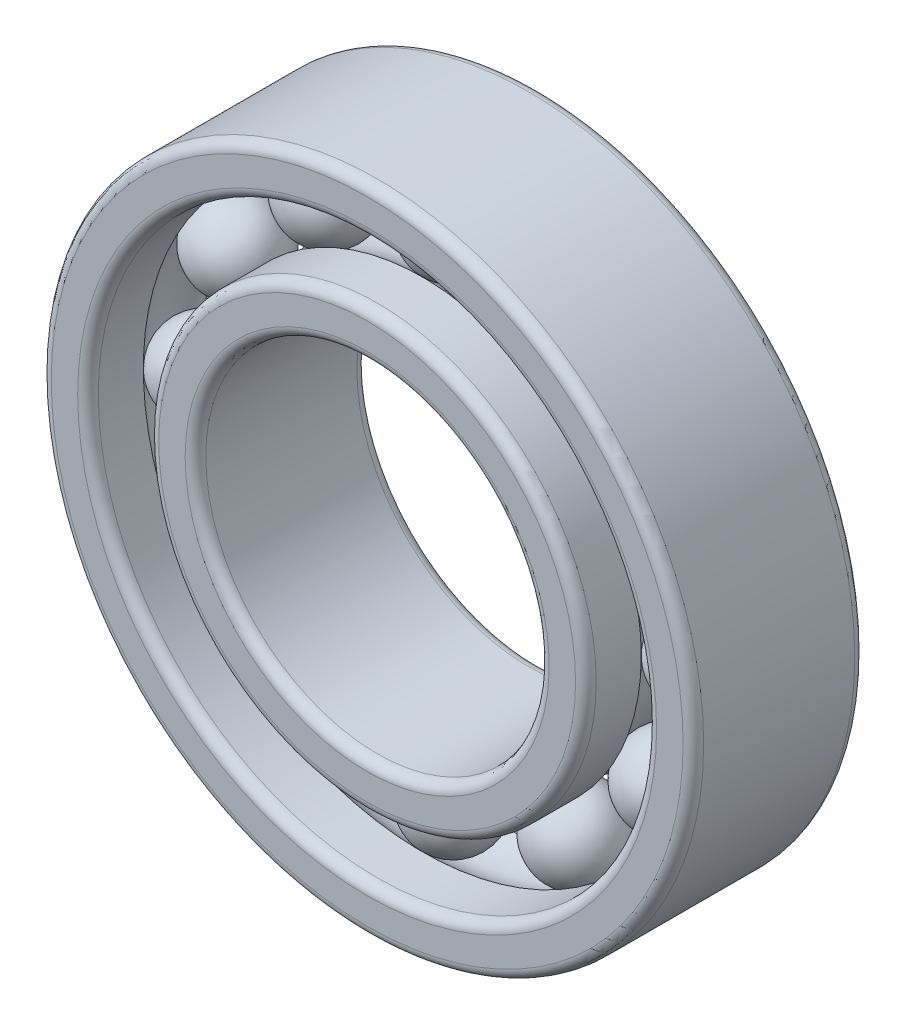
ISO-10303-21;
HEADER;
FILE_DESCRIPTION(('STEP AP214'),'2;1');
FILE_NAME('part.step','',(''),(''),'','','');
FILE_SCHEMA(('AUTOMOTIVE_DESIGN { 1 0 10303 214 1 1 1 1 }'));
ENDSEC;
DATA;
#1=APPLICATION_CONTEXT('core data for automotive mechanical design processes');
#2=APPLICATION_PROTOCOL_DEFINITION('international standard','automotive_design',2000,#1);
#3=PRODUCT_CONTEXT('',#1,'mechanical');
#4=PRODUCT('Part','Part','',(#3));
#5=PRODUCT_RELATED_PRODUCT_CATEGORY('part','',(#4));
#6=PRODUCT_DEFINITION_FORMATION('','',#4);
#7=PRODUCT_DEFINITION_CONTEXT('part definition',#1,'design');
#8=PRODUCT_DEFINITION('design','',#6,#7);
#9=PRODUCT_DEFINITION_SHAPE('','',#8);
#10=(LENGTH_UNIT() NAMED_UNIT(*) SI_UNIT(.MILLI.,.METRE.));
#11=(NAMED_UNIT(*) PLANE_ANGLE_UNIT() SI_UNIT($,.RADIAN.));
#12=(NAMED_UNIT(*) SI_UNIT($,.STERADIAN.) SOLID_ANGLE_UNIT());
#13=UNCERTAINTY_MEASURE_WITH_UNIT(LENGTH_MEASURE(1.E-05),#10,'distance_accuracy_value','');
#14=(GEOMETRIC_REPRESENTATION_CONTEXT(3) GLOBAL_UNCERTAINTY_ASSIGNED_CONTEXT((#13)) GLOBAL_UNIT_ASSIGNED_CONTEXT((#10,
#11,#12)) REPRESENTATION_CONTEXT('',''));
#15=CARTESIAN_POINT('',(0.,0.,0.));
#16=DIRECTION('',(0.,0.,1.));
#17=DIRECTION('',(1.,0.,0.));
#18=AXIS2_PLACEMENT_3D('',#15,#16,#17);
#19=CARTESIAN_POINT('',(3.62499999999992,6.27868417743723,0.));
#20=DIRECTION('',(0.,0.,1.));
#21=DIRECTION('',(0.499999999999989,0.866025403784445,0.));
#22=AXIS2_PLACEMENT_3D('',#19,#20,#21);
#23=SPHERICAL_SURFACE('',#22,1.25);
#24=CARTESIAN_POINT('',(3.62499999999992,6.27868417743723,1.25));
#25=VERTEX_POINT('',#24);
#26=VERTEX_LOOP('',#25);
#27=FACE_BOUND('',#26,.T.);
#28=ADVANCED_FACE('F38',(#27),#23,.T.);
#29=CLOSED_SHELL('',(#28));
#30=MANIFOLD_SOLID_BREP('B2',#29);
#31=CARTESIAN_POINT('',(6.27868417743714,3.62500000000007,0.));
#32=DIRECTION('',(0.,0.,1.));
#33=DIRECTION('',(0.866025403784433,0.50000000000001,0.));
#34=AXIS2_PLACEMENT_3D('',#31,#32,#33);
#35=SPHERICAL_SURFACE('',#34,1.25);
#36=CARTESIAN_POINT('',(6.27868417743714,3.62500000000007,1.25));
#37=VERTEX_POINT('',#36);
#38=VERTEX_LOOP('',#37);
#39=FACE_BOUND('',#38,.T.);
#40=ADVANCED_FACE('F57',(#39),#35,.T.);
#41=CLOSED_SHELL('',(#40));
#42=MANIFOLD_SOLID_BREP('B6',#41);
#43=CARTESIAN_POINT('',(7.25,0.,0.));
#44=DIRECTION('',(0.,0.,1.));
#45=DIRECTION('',(1.,0.,0.));
#46=AXIS2_PLACEMENT_3D('',#43,#44,#45);
#47=SPHERICAL_SURFACE('',#46,1.25);
#48=CARTESIAN_POINT('',(7.25,0.,1.25));
#49=VERTEX_POINT('',#48);
#50=VERTEX_LOOP('',#49);
#51=FACE_BOUND('',#50,.T.);
#52=ADVANCED_FACE('F76',(#51),#47,.T.);
#53=CLOSED_SHELL('',(#52));
#54=MANIFOLD_SOLID_BREP('B34',#53);
#55=CARTESIAN_POINT('',(6.27868417743721,-3.62499999999994,0.));
#56=DIRECTION('',(0.,0.,1.));
#57=DIRECTION('',(0.866025403784443,-0.499999999999992,0.));
#58=AXIS2_PLACEMENT_3D('',#55,#56,#57);
#59=SPHERICAL_SURFACE('',#58,1.25);
#60=CARTESIAN_POINT('',(6.27868417743721,-3.62499999999994,1.25));
#61=VERTEX_POINT('',#60);
#62=VERTEX_LOOP('',#61);
#63=FACE_BOUND('',#62,.T.);
#64=ADVANCED_FACE('F95',(#63),#59,.T.);
#65=CLOSED_SHELL('',(#64));
#66=MANIFOLD_SOLID_BREP('B53',#65);
#67=CARTESIAN_POINT('',(3.62500000000005,-6.27868417743715,0.));
#68=DIRECTION('',(0.,0.,1.));
#69=DIRECTION('',(0.500000000000007,-0.866025403784435,0.));
#70=AXIS2_PLACEMENT_3D('',#67,#68,#69);
#71=SPHERICAL_SURFACE('',#70,1.25);
#72=CARTESIAN_POINT('',(3.62500000000005,-6.27868417743715,1.25));
#73=VERTEX_POINT('',#72);
#74=VERTEX_LOOP('',#73);
#75=FACE_BOUND('',#74,.T.);
#76=ADVANCED_FACE('F114',(#75),#71,.T.);
#77=CLOSED_SHELL('',(#76));
#78=MANIFOLD_SOLID_BREP('B72',#77);
#79=CARTESIAN_POINT('',(0.,-7.25,0.));
#80=DIRECTION('',(0.,0.,1.));
#81=DIRECTION('',(0.,-1.,0.));
#82=AXIS2_PLACEMENT_3D('',#79,#80,#81);
#83=SPHERICAL_SURFACE('',#82,1.25);
#84=CARTESIAN_POINT('',(0.,-7.25,1.25));
#85=VERTEX_POINT('',#84);
#86=VERTEX_LOOP('',#85);
#87=FACE_BOUND('',#86,.T.);
#88=ADVANCED_FACE('F133',(#87),#83,.T.);
#89=CLOSED_SHELL('',(#88));
#90=MANIFOLD_SOLID_BREP('B91',#89);
#91=CARTESIAN_POINT('',(-3.62499999999996,-6.2786841774372,0.));
#92=DIRECTION('',(0.,0.,1.));
#93=DIRECTION('',(-0.499999999999995,-0.866025403784442,0.));
#94=AXIS2_PLACEMENT_3D('',#91,#92,#93);
#95=SPHERICAL_SURFACE('',#94,1.25);
#96=CARTESIAN_POINT('',(-3.62499999999996,-6.2786841774372,1.25));
#97=VERTEX_POINT('',#96);
#98=VERTEX_LOOP('',#97);
#99=FACE_BOUND('',#98,.T.);
#100=ADVANCED_FACE('F152',(#99),#95,.T.);
#101=CLOSED_SHELL('',(#100));
#102=MANIFOLD_SOLID_BREP('B110',#101);
#103=CARTESIAN_POINT('',(-6.27868417743716,-3.62500000000003,0.));
#104=DIRECTION('',(0.,0.,1.));
#105=DIRECTION('',(-0.866025403784436,-0.500000000000004,0.));
#106=AXIS2_PLACEMENT_3D('',#103,#104,#105);
#107=SPHERICAL_SURFACE('',#106,1.25);
#108=CARTESIAN_POINT('',(-6.27868417743716,-3.62500000000003,1.25));
#109=VERTEX_POINT('',#108);
#110=VERTEX_LOOP('',#109);
#111=FACE_BOUND('',#110,.T.);
#112=ADVANCED_FACE('F171',(#111),#107,.T.);
#113=CLOSED_SHELL('',(#112));
#114=MANIFOLD_SOLID_BREP('B129',#113);
#115=CARTESIAN_POINT('',(-7.25,0.,0.));
#116=DIRECTION('',(0.,0.,1.));
#117=DIRECTION('',(-1.,0.,0.));
#118=AXIS2_PLACEMENT_3D('',#115,#116,#117);
#119=SPHERICAL_SURFACE('',#118,1.25);
#120=CARTESIAN_POINT('',(-7.25,0.,1.25));
#121=VERTEX_POINT('',#120);
#122=VERTEX_LOOP('',#121);
#123=FACE_BOUND('',#122,.T.);
#124=ADVANCED_FACE('F190',(#123),#119,.T.);
#125=CLOSED_SHELL('',(#124));
#126=MANIFOLD_SOLID_BREP('B148',#125);
#127=CARTESIAN_POINT('',(-6.27868417743719,3.62499999999999,0.));
#128=DIRECTION('',(0.,0.,1.));
#129=DIRECTION('',(-0.86602540378444,0.499999999999998,0.));
#130=AXIS2_PLACEMENT_3D('',#127,#128,#129);
#131=SPHERICAL_SURFACE('',#130,1.25);
#132=CARTESIAN_POINT('',(-6.27868417743719,3.62499999999999,1.25));
#133=VERTEX_POINT('',#132);
#134=VERTEX_LOOP('',#133);
#135=FACE_BOUND('',#134,.T.);
#136=ADVANCED_FACE('F209',(#135),#131,.T.);
#137=CLOSED_SHELL('',(#136));
#138=MANIFOLD_SOLID_BREP('B167',#137);
#139=CARTESIAN_POINT('',(-3.62500000000001,6.27868417743718,0.));
#140=DIRECTION('',(0.,0.,1.));
#141=DIRECTION('',(-0.500000000000001,0.866025403784438,0.));
#142=AXIS2_PLACEMENT_3D('',#139,#140,#141);
#143=SPHERICAL_SURFACE('',#142,1.25);
#144=CARTESIAN_POINT('',(-3.62500000000001,6.27868417743718,1.25));
#145=VERTEX_POINT('',#144);
#146=VERTEX_LOOP('',#145);
#147=FACE_BOUND('',#146,.T.);
#148=ADVANCED_FACE('F228',(#147),#143,.T.);
#149=CLOSED_SHELL('',(#148));
#150=MANIFOLD_SOLID_BREP('B186',#149);
#151=CARTESIAN_POINT('',(0.,7.25,0.));
#152=DIRECTION('',(0.,0.,1.));
#153=DIRECTION('',(0.,1.,0.));
#154=AXIS2_PLACEMENT_3D('',#151,#152,#153);
#155=SPHERICAL_SURFACE('',#154,1.25);
#156=CARTESIAN_POINT('',(0.,7.25,1.25));
#157=VERTEX_POINT('',#156);
#158=VERTEX_LOOP('',#157);
#159=FACE_BOUND('',#158,.T.);
#160=ADVANCED_FACE('F249',(#159),#155,.T.);
#161=CLOSED_SHELL('',(#160));
#162=MANIFOLD_SOLID_BREP('B205',#161);
#163=CARTESIAN_POINT('',(0.,0.,0.));
#164=DIRECTION('',(0.,0.,1.));
#165=DIRECTION('',(1.,0.,0.));
#166=AXIS2_PLACEMENT_3D('',#163,#164,#165);
#167=TOROIDAL_SURFACE('',#166,7.25,1.25);
#168=CARTESIAN_POINT('',(0.,0.,-0.887749964798647));
#169=DIRECTION('',(0.,0.,1.));
#170=DIRECTION('',(1.,0.,0.));
#171=AXIS2_PLACEMENT_3D('',#168,#169,#170);
#172=CIRCLE('',#171,6.37);
#173=CARTESIAN_POINT('',(6.37,0.,-0.887749964798647));
#174=VERTEX_POINT('',#173);
#175=EDGE_CURVE('E304',#174,#174,#172,.T.);
#176=ORIENTED_EDGE('',*,*,#175,.T.);
#177=EDGE_LOOP('',(#176));
#178=FACE_BOUND('',#177,.T.);
#179=CARTESIAN_POINT('',(0.,0.,0.887749964798647));
#180=DIRECTION('',(0.,0.,1.));
#181=DIRECTION('',(1.,0.,0.));
#182=AXIS2_PLACEMENT_3D('',#179,#180,#181);
#183=CIRCLE('',#182,6.37);
#184=CARTESIAN_POINT('',(6.37,0.,0.887749964798647));
#185=VERTEX_POINT('',#184);
#186=EDGE_CURVE('E301',#185,#185,#183,.T.);
#187=ORIENTED_EDGE('',*,*,#186,.F.);
#188=EDGE_LOOP('',(#187));
#189=FACE_BOUND('',#188,.T.);
#190=ADVANCED_FACE('F269',(#178,#189),#167,.F.);
#191=CARTESIAN_POINT('',(0.,0.,0.));
#192=DIRECTION('',(0.,0.,1.));
#193=DIRECTION('',(1.,0.,0.));
#194=AXIS2_PLACEMENT_3D('',#191,#192,#193);
#195=CYLINDRICAL_SURFACE('',#194,6.37);
#196=CARTESIAN_POINT('',(0.,0.,2.2));
#197=DIRECTION('',(0.,0.,-1.));
#198=DIRECTION('',(-1.,0.,0.));
#199=AXIS2_PLACEMENT_3D('',#196,#197,#198);
#200=CIRCLE('',#199,6.37);
#201=CARTESIAN_POINT('',(-6.37,0.,2.2));
#202=VERTEX_POINT('',#201);
#203=EDGE_CURVE('E248',#202,#202,#200,.T.);
#204=ORIENTED_EDGE('',*,*,#203,.T.);
#205=EDGE_LOOP('',(#204));
#206=FACE_BOUND('',#205,.T.);
#207=ORIENTED_EDGE('',*,*,#186,.T.);
#208=EDGE_LOOP('',(#207));
#209=FACE_BOUND('',#208,.T.);
#210=ADVANCED_FACE('F327',(#206,#209),#195,.T.);
#211=CARTESIAN_POINT('',(0.,0.,2.5));
#212=DIRECTION('',(0.,0.,-1.));
#213=DIRECTION('',(-1.,0.,0.));
#214=AXIS2_PLACEMENT_3D('',#211,#212,#213);
#215=PLANE('',#214);
#216=CARTESIAN_POINT('',(0.,0.,2.5));
#217=DIRECTION('',(0.,0.,-1.));
#218=DIRECTION('',(-1.,0.,0.));
#219=AXIS2_PLACEMENT_3D('',#216,#217,#218);
#220=CIRCLE('',#219,6.07);
#221=CARTESIAN_POINT('',(-6.07,0.,2.5));
#222=VERTEX_POINT('',#221);
#223=EDGE_CURVE('E276',#222,#222,#220,.F.);
#224=ORIENTED_EDGE('',*,*,#223,.T.);
#225=EDGE_LOOP('',(#224));
#226=FACE_BOUND('',#225,.T.);
#227=CARTESIAN_POINT('',(0.,0.,2.5));
#228=DIRECTION('',(0.,0.,-1.));
#229=DIRECTION('',(-1.,0.,0.));
#230=AXIS2_PLACEMENT_3D('',#227,#228,#229);
#231=CIRCLE('',#230,5.3);
#232=CARTESIAN_POINT('',(-5.3,0.,2.5));
#233=VERTEX_POINT('',#232);
#234=EDGE_CURVE('E280',#233,#233,#231,.T.);
#235=ORIENTED_EDGE('',*,*,#234,.T.);
#236=EDGE_LOOP('',(#235));
#237=FACE_BOUND('',#236,.T.);
#238=ADVANCED_FACE('F332',(#226,#237),#215,.F.);
#239=CARTESIAN_POINT('',(0.,0.,0.));
#240=DIRECTION('',(0.,0.,1.));
#241=DIRECTION('',(1.,0.,0.));
#242=AXIS2_PLACEMENT_3D('',#239,#240,#241);
#243=CYLINDRICAL_SURFACE('',#242,5.);
#244=CARTESIAN_POINT('',(0.,0.,-2.2));
#245=DIRECTION('',(0.,0.,-1.));
#246=DIRECTION('',(-1.,0.,0.));
#247=AXIS2_PLACEMENT_3D('',#244,#245,#246);
#248=CIRCLE('',#247,5.);
#249=CARTESIAN_POINT('',(-5.,0.,-2.2));
#250=VERTEX_POINT('',#249);
#251=EDGE_CURVE('E284',#250,#250,#248,.T.);
#252=ORIENTED_EDGE('',*,*,#251,.T.);
#253=EDGE_LOOP('',(#252));
#254=FACE_BOUND('',#253,.T.);
#255=CARTESIAN_POINT('',(0.,0.,2.2));
#256=DIRECTION('',(0.,0.,-1.));
#257=DIRECTION('',(-1.,0.,0.));
#258=AXIS2_PLACEMENT_3D('',#255,#256,#257);
#259=CIRCLE('',#258,5.);
#260=CARTESIAN_POINT('',(-5.,0.,2.2));
#261=VERTEX_POINT('',#260);
#262=EDGE_CURVE('E289',#261,#261,#259,.F.);
#263=ORIENTED_EDGE('',*,*,#262,.T.);
#264=EDGE_LOOP('',(#263));
#265=FACE_BOUND('',#264,.T.);
#266=ADVANCED_FACE('F323',(#254,#265),#243,.F.);
#267=CARTESIAN_POINT('',(0.,0.,-2.5));
#268=DIRECTION('',(0.,0.,-1.));
#269=DIRECTION('',(-1.,0.,0.));
#270=AXIS2_PLACEMENT_3D('',#267,#268,#269);
#271=PLANE('',#270);
#272=CARTESIAN_POINT('',(0.,0.,-2.5));
#273=DIRECTION('',(0.,0.,-1.));
#274=DIRECTION('',(-1.,0.,0.));
#275=AXIS2_PLACEMENT_3D('',#272,#273,#274);
#276=CIRCLE('',#275,6.07);
#277=CARTESIAN_POINT('',(-6.07,0.,-2.5));
#278=VERTEX_POINT('',#277);
#279=EDGE_CURVE('E292',#278,#278,#276,.T.);
#280=ORIENTED_EDGE('',*,*,#279,.T.);
#281=EDGE_LOOP('',(#280));
#282=FACE_BOUND('',#281,.T.);
#283=CARTESIAN_POINT('',(0.,0.,-2.5));
#284=DIRECTION('',(0.,0.,-1.));
#285=DIRECTION('',(-1.,0.,0.));
#286=AXIS2_PLACEMENT_3D('',#283,#284,#285);
#287=CIRCLE('',#286,5.3);
#288=CARTESIAN_POINT('',(-5.3,0.,-2.5));
#289=VERTEX_POINT('',#288);
#290=EDGE_CURVE('E295',#289,#289,#287,.F.);
#291=ORIENTED_EDGE('',*,*,#290,.T.);
#292=EDGE_LOOP('',(#291));
#293=FACE_BOUND('',#292,.T.);
#294=ADVANCED_FACE('F313',(#282,#293),#271,.T.);
#295=CARTESIAN_POINT('',(0.,0.,0.));
#296=DIRECTION('',(0.,0.,1.));
#297=DIRECTION('',(1.,0.,0.));
#298=AXIS2_PLACEMENT_3D('',#295,#296,#297);
#299=CYLINDRICAL_SURFACE('',#298,6.37);
#300=CARTESIAN_POINT('',(0.,0.,-2.2));
#301=DIRECTION('',(0.,0.,-1.));
#302=DIRECTION('',(-1.,0.,0.));
#303=AXIS2_PLACEMENT_3D('',#300,#301,#302);
#304=CIRCLE('',#303,6.37);
#305=CARTESIAN_POINT('',(-6.37,0.,-2.2));
#306=VERTEX_POINT('',#305);
#307=EDGE_CURVE('E298',#306,#306,#304,.F.);
#308=ORIENTED_EDGE('',*,*,#307,.T.);
#309=EDGE_LOOP('',(#308));
#310=FACE_BOUND('',#309,.T.);
#311=ORIENTED_EDGE('',*,*,#175,.F.);
#312=EDGE_LOOP('',(#311));
#313=FACE_BOUND('',#312,.T.);
#314=ADVANCED_FACE('F310',(#310,#313),#299,.T.);
#315=CARTESIAN_POINT('',(0.,0.,-2.2));
#316=DIRECTION('',(0.,0.,-1.));
#317=DIRECTION('',(-1.,0.,0.));
#318=AXIS2_PLACEMENT_3D('',#315,#316,#317);
#319=TOROIDAL_SURFACE('',#318,6.07,0.3);
#320=ORIENTED_EDGE('',*,*,#279,.F.);
#321=EDGE_LOOP('',(#320));
#322=FACE_BOUND('',#321,.T.);
#323=ORIENTED_EDGE('',*,*,#307,.F.);
#324=EDGE_LOOP('',(#323));
#325=FACE_BOUND('',#324,.T.);
#326=ADVANCED_FACE('F312',(#322,#325),#319,.T.);
#327=CARTESIAN_POINT('',(0.,0.,-2.2));
#328=DIRECTION('',(0.,0.,-1.));
#329=DIRECTION('',(-1.,0.,0.));
#330=AXIS2_PLACEMENT_3D('',#327,#328,#329);
#331=TOROIDAL_SURFACE('',#330,5.3,0.3);
#332=ORIENTED_EDGE('',*,*,#251,.F.);
#333=EDGE_LOOP('',(#332));
#334=FACE_BOUND('',#333,.T.);
#335=ORIENTED_EDGE('',*,*,#290,.F.);
#336=EDGE_LOOP('',(#335));
#337=FACE_BOUND('',#336,.T.);
#338=ADVANCED_FACE('F320',(#334,#337),#331,.T.);
#339=CARTESIAN_POINT('',(0.,0.,2.2));
#340=DIRECTION('',(0.,0.,-1.));
#341=DIRECTION('',(-1.,0.,0.));
#342=AXIS2_PLACEMENT_3D('',#339,#340,#341);
#343=TOROIDAL_SURFACE('',#342,6.07,0.3);
#344=ORIENTED_EDGE('',*,*,#203,.F.);
#345=EDGE_LOOP('',(#344));
#346=FACE_BOUND('',#345,.T.);
#347=ORIENTED_EDGE('',*,*,#223,.F.);
#348=EDGE_LOOP('',(#347));
#349=FACE_BOUND('',#348,.T.);
#350=ADVANCED_FACE('F337',(#346,#349),#343,.T.);
#351=CARTESIAN_POINT('',(0.,0.,2.2));
#352=DIRECTION('',(0.,0.,-1.));
#353=DIRECTION('',(-1.,0.,0.));
#354=AXIS2_PLACEMENT_3D('',#351,#352,#353);
#355=TOROIDAL_SURFACE('',#354,5.3,0.3);
#356=ORIENTED_EDGE('',*,*,#234,.F.);
#357=EDGE_LOOP('',(#356));
#358=FACE_BOUND('',#357,.T.);
#359=ORIENTED_EDGE('',*,*,#262,.F.);
#360=EDGE_LOOP('',(#359));
#361=FACE_BOUND('',#360,.T.);
#362=ADVANCED_FACE('F271',(#358,#361),#355,.T.);
#363=CLOSED_SHELL('',(#190,#210,#238,#266,#294,#314,#326,#338,#350,#362));
#364=MANIFOLD_SOLID_BREP('B224',#363);
#365=CARTESIAN_POINT('',(0.,0.,0.));
#366=DIRECTION('',(0.,0.,1.));
#367=DIRECTION('',(1.,0.,0.));
#368=AXIS2_PLACEMENT_3D('',#365,#366,#367);
#369=TOROIDAL_SURFACE('',#368,7.25,1.25);
#370=CARTESIAN_POINT('',(0.,0.,0.887749964798647));
#371=DIRECTION('',(0.,0.,1.));
#372=DIRECTION('',(1.,0.,0.));
#373=AXIS2_PLACEMENT_3D('',#370,#371,#372);
#374=CIRCLE('',#373,8.13);
#375=CARTESIAN_POINT('',(8.13,0.,0.887749964798647));
#376=VERTEX_POINT('',#375);
#377=EDGE_CURVE('E456',#376,#376,#374,.T.);
#378=ORIENTED_EDGE('',*,*,#377,.T.);
#379=EDGE_LOOP('',(#378));
#380=FACE_BOUND('',#379,.T.);
#381=CARTESIAN_POINT('',(0.,0.,-0.887749964798647));
#382=DIRECTION('',(0.,0.,1.));
#383=DIRECTION('',(1.,0.,0.));
#384=AXIS2_PLACEMENT_3D('',#381,#382,#383);
#385=CIRCLE('',#384,8.13);
#386=CARTESIAN_POINT('',(8.13,0.,-0.887749964798647));
#387=VERTEX_POINT('',#386);
#388=EDGE_CURVE('E453',#387,#387,#385,.T.);
#389=ORIENTED_EDGE('',*,*,#388,.F.);
#390=EDGE_LOOP('',(#389));
#391=FACE_BOUND('',#390,.T.);
#392=ADVANCED_FACE('F421',(#380,#391),#369,.F.);
#393=CARTESIAN_POINT('',(0.,0.,0.));
#394=DIRECTION('',(0.,0.,1.));
#395=DIRECTION('',(1.,0.,0.));
#396=AXIS2_PLACEMENT_3D('',#393,#394,#395);
#397=CYLINDRICAL_SURFACE('',#396,8.13);
#398=CARTESIAN_POINT('',(0.,0.,-2.2));
#399=DIRECTION('',(0.,0.,-1.));
#400=DIRECTION('',(-1.,0.,0.));
#401=AXIS2_PLACEMENT_3D('',#398,#399,#400);
#402=CIRCLE('',#401,8.13);
#403=CARTESIAN_POINT('',(-8.13,0.,-2.2));
#404=VERTEX_POINT('',#403);
#405=EDGE_CURVE('E444',#404,#404,#402,.T.);
#406=ORIENTED_EDGE('',*,*,#405,.T.);
#407=EDGE_LOOP('',(#406));
#408=FACE_BOUND('',#407,.T.);
#409=ORIENTED_EDGE('',*,*,#388,.T.);
#410=EDGE_LOOP('',(#409));
#411=FACE_BOUND('',#410,.T.);
#412=ADVANCED_FACE('F479',(#408,#411),#397,.F.);
#413=CARTESIAN_POINT('',(0.,0.,-2.5));
#414=DIRECTION('',(0.,0.,-1.));
#415=DIRECTION('',(-1.,0.,0.));
#416=AXIS2_PLACEMENT_3D('',#413,#414,#415);
#417=PLANE('',#416);
#418=CARTESIAN_POINT('',(0.,0.,-2.5));
#419=DIRECTION('',(0.,0.,-1.));
#420=DIRECTION('',(-1.,0.,0.));
#421=AXIS2_PLACEMENT_3D('',#418,#419,#420);
#422=CIRCLE('',#421,8.43);
#423=CARTESIAN_POINT('',(-8.43,0.,-2.5));
#424=VERTEX_POINT('',#423);
#425=EDGE_CURVE('E447',#424,#424,#422,.F.);
#426=ORIENTED_EDGE('',*,*,#425,.T.);
#427=EDGE_LOOP('',(#426));
#428=FACE_BOUND('',#427,.T.);
#429=CARTESIAN_POINT('',(0.,0.,-2.5));
#430=DIRECTION('',(0.,0.,-1.));
#431=DIRECTION('',(-1.,0.,0.));
#432=AXIS2_PLACEMENT_3D('',#429,#430,#431);
#433=CIRCLE('',#432,9.2);
#434=CARTESIAN_POINT('',(-9.2,0.,-2.5));
#435=VERTEX_POINT('',#434);
#436=EDGE_CURVE('E450',#435,#435,#433,.T.);
#437=ORIENTED_EDGE('',*,*,#436,.T.);
#438=EDGE_LOOP('',(#437));
#439=FACE_BOUND('',#438,.T.);
#440=ADVANCED_FACE('F484',(#428,#439),#417,.T.);
#441=CARTESIAN_POINT('',(0.,0.,0.));
#442=DIRECTION('',(0.,0.,1.));
#443=DIRECTION('',(1.,0.,0.));
#444=AXIS2_PLACEMENT_3D('',#441,#442,#443);
#445=CYLINDRICAL_SURFACE('',#444,9.5);
#446=CARTESIAN_POINT('',(0.,0.,-2.2));
#447=DIRECTION('',(0.,0.,-1.));
#448=DIRECTION('',(-1.,0.,0.));
#449=AXIS2_PLACEMENT_3D('',#446,#447,#448);
#450=CIRCLE('',#449,9.5);
#451=CARTESIAN_POINT('',(-9.5,0.,-2.2));
#452=VERTEX_POINT('',#451);
#453=EDGE_CURVE('E268',#452,#452,#450,.F.);
#454=ORIENTED_EDGE('',*,*,#453,.T.);
#455=EDGE_LOOP('',(#454));
#456=FACE_BOUND('',#455,.T.);
#457=CARTESIAN_POINT('',(0.,0.,2.2));
#458=DIRECTION('',(0.,0.,-1.));
#459=DIRECTION('',(-1.,0.,0.));
#460=AXIS2_PLACEMENT_3D('',#457,#458,#459);
#461=CIRCLE('',#460,9.5);
#462=CARTESIAN_POINT('',(-9.5,0.,2.2));
#463=VERTEX_POINT('',#462);
#464=EDGE_CURVE('E428',#463,#463,#461,.T.);
#465=ORIENTED_EDGE('',*,*,#464,.T.);
#466=EDGE_LOOP('',(#465));
#467=FACE_BOUND('',#466,.T.);
#468=ADVANCED_FACE('F475',(#456,#467),#445,.T.);
#469=CARTESIAN_POINT('',(0.,0.,2.5));
#470=DIRECTION('',(0.,0.,-1.));
#471=DIRECTION('',(-1.,0.,0.));
#472=AXIS2_PLACEMENT_3D('',#469,#470,#471);
#473=PLANE('',#472);
#474=CARTESIAN_POINT('',(0.,0.,2.5));
#475=DIRECTION('',(0.,0.,-1.));
#476=DIRECTION('',(-1.,0.,0.));
#477=AXIS2_PLACEMENT_3D('',#474,#475,#476);
#478=CIRCLE('',#477,8.43);
#479=CARTESIAN_POINT('',(-8.43,0.,2.5));
#480=VERTEX_POINT('',#479);
#481=EDGE_CURVE('E432',#480,#480,#478,.T.);
#482=ORIENTED_EDGE('',*,*,#481,.T.);
#483=EDGE_LOOP('',(#482));
#484=FACE_BOUND('',#483,.T.);
#485=CARTESIAN_POINT('',(0.,0.,2.5));
#486=DIRECTION('',(0.,0.,-1.));
#487=DIRECTION('',(-1.,0.,0.));
#488=AXIS2_PLACEMENT_3D('',#485,#486,#487);
#489=CIRCLE('',#488,9.2);
#490=CARTESIAN_POINT('',(-9.2,0.,2.5));
#491=VERTEX_POINT('',#490);
#492=EDGE_CURVE('E436',#491,#491,#489,.F.);
#493=ORIENTED_EDGE('',*,*,#492,.T.);
#494=EDGE_LOOP('',(#493));
#495=FACE_BOUND('',#494,.T.);
#496=ADVANCED_FACE('F465',(#484,#495),#473,.F.);
#497=CARTESIAN_POINT('',(0.,0.,0.));
#498=DIRECTION('',(0.,0.,1.));
#499=DIRECTION('',(1.,0.,0.));
#500=AXIS2_PLACEMENT_3D('',#497,#498,#499);
#501=CYLINDRICAL_SURFACE('',#500,8.13);
#502=CARTESIAN_POINT('',(0.,0.,2.2));
#503=DIRECTION('',(0.,0.,-1.));
#504=DIRECTION('',(-1.,0.,0.));
#505=AXIS2_PLACEMENT_3D('',#502,#503,#504);
#506=CIRCLE('',#505,8.13);
#507=CARTESIAN_POINT('',(-8.13,0.,2.2));
#508=VERTEX_POINT('',#507);
#509=EDGE_CURVE('E441',#508,#508,#506,.F.);
#510=ORIENTED_EDGE('',*,*,#509,.T.);
#511=EDGE_LOOP('',(#510));
#512=FACE_BOUND('',#511,.T.);
#513=ORIENTED_EDGE('',*,*,#377,.F.);
#514=EDGE_LOOP('',(#513));
#515=FACE_BOUND('',#514,.T.);
#516=ADVANCED_FACE('F462',(#512,#515),#501,.F.);
#517=CARTESIAN_POINT('',(0.,0.,-2.2));
#518=DIRECTION('',(0.,0.,-1.));
#519=DIRECTION('',(-1.,0.,0.));
#520=AXIS2_PLACEMENT_3D('',#517,#518,#519);
#521=TOROIDAL_SURFACE('',#520,8.43,0.3);
#522=ORIENTED_EDGE('',*,*,#405,.F.);
#523=EDGE_LOOP('',(#522));
#524=FACE_BOUND('',#523,.T.);
#525=ORIENTED_EDGE('',*,*,#425,.F.);
#526=EDGE_LOOP('',(#525));
#527=FACE_BOUND('',#526,.T.);
#528=ADVANCED_FACE('F464',(#524,#527),#521,.T.);
#529=CARTESIAN_POINT('',(0.,0.,2.2));
#530=DIRECTION('',(0.,0.,-1.));
#531=DIRECTION('',(-1.,0.,0.));
#532=AXIS2_PLACEMENT_3D('',#529,#530,#531);
#533=TOROIDAL_SURFACE('',#532,8.43,0.3);
#534=ORIENTED_EDGE('',*,*,#481,.F.);
#535=EDGE_LOOP('',(#534));
#536=FACE_BOUND('',#535,.T.);
#537=ORIENTED_EDGE('',*,*,#509,.F.);
#538=EDGE_LOOP('',(#537));
#539=FACE_BOUND('',#538,.T.);
#540=ADVANCED_FACE('F472',(#536,#539),#533,.T.);
#541=CARTESIAN_POINT('',(0.,0.,-2.2));
#542=DIRECTION('',(0.,0.,-1.));
#543=DIRECTION('',(-1.,0.,0.));
#544=AXIS2_PLACEMENT_3D('',#541,#542,#543);
#545=TOROIDAL_SURFACE('',#544,9.2,0.3);
#546=ORIENTED_EDGE('',*,*,#436,.F.);
#547=EDGE_LOOP('',(#546));
#548=FACE_BOUND('',#547,.T.);
#549=ORIENTED_EDGE('',*,*,#453,.F.);
#550=EDGE_LOOP('',(#549));
#551=FACE_BOUND('',#550,.T.);
#552=ADVANCED_FACE('F490',(#548,#551),#545,.T.);
#553=CARTESIAN_POINT('',(0.,0.,2.2));
#554=DIRECTION('',(0.,0.,-1.));
#555=DIRECTION('',(-1.,0.,0.));
#556=AXIS2_PLACEMENT_3D('',#553,#554,#555);
#557=TOROIDAL_SURFACE('',#556,9.2,0.3);
#558=ORIENTED_EDGE('',*,*,#464,.F.);
#559=EDGE_LOOP('',(#558));
#560=FACE_BOUND('',#559,.T.);
#561=ORIENTED_EDGE('',*,*,#492,.F.);
#562=EDGE_LOOP('',(#561));
#563=FACE_BOUND('',#562,.T.);
#564=ADVANCED_FACE('F423',(#560,#563),#557,.T.);
#565=CLOSED_SHELL('',(#392,#412,#440,#468,#496,#516,#528,#540,#552,#564));
#566=MANIFOLD_SOLID_BREP('B243',#565);
#567=ADVANCED_BREP_SHAPE_REPRESENTATION('',(#18,#30,#42,#54,#66,#78,#90,#102,#114,#126,#138,
#150,#162,#364,#566),#14);
#568=SHAPE_DEFINITION_REPRESENTATION(#9,#567);
ENDSEC;
END-ISO-10303-21;
